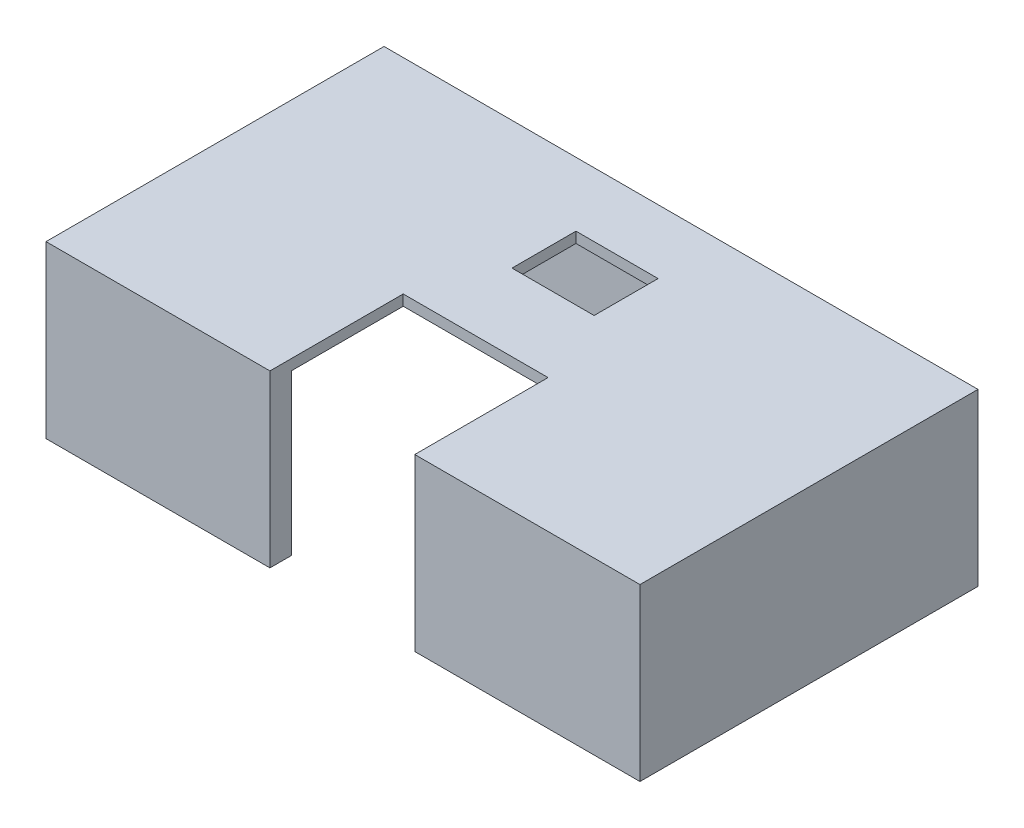
ISO-10303-21;
HEADER;
FILE_DESCRIPTION(('STEP AP214'),'2;1');
FILE_NAME('part.step','',(''),(''),'','','');
FILE_SCHEMA(('AUTOMOTIVE_DESIGN { 1 0 10303 214 1 1 1 1 }'));
ENDSEC;
DATA;
#1=APPLICATION_CONTEXT('core data for automotive mechanical design processes');
#2=APPLICATION_PROTOCOL_DEFINITION('international standard','automotive_design',2000,#1);
#3=PRODUCT_CONTEXT('',#1,'mechanical');
#4=PRODUCT('Part','Part','',(#3));
#5=PRODUCT_RELATED_PRODUCT_CATEGORY('part','',(#4));
#6=PRODUCT_DEFINITION_FORMATION('','',#4);
#7=PRODUCT_DEFINITION_CONTEXT('part definition',#1,'design');
#8=PRODUCT_DEFINITION('design','',#6,#7);
#9=PRODUCT_DEFINITION_SHAPE('','',#8);
#10=(LENGTH_UNIT() NAMED_UNIT(*) SI_UNIT(.MILLI.,.METRE.));
#11=(NAMED_UNIT(*) PLANE_ANGLE_UNIT() SI_UNIT($,.RADIAN.));
#12=(NAMED_UNIT(*) SI_UNIT($,.STERADIAN.) SOLID_ANGLE_UNIT());
#13=UNCERTAINTY_MEASURE_WITH_UNIT(LENGTH_MEASURE(1.E-05),#10,'distance_accuracy_value','');
#14=(GEOMETRIC_REPRESENTATION_CONTEXT(3) GLOBAL_UNCERTAINTY_ASSIGNED_CONTEXT((#13)) GLOBAL_UNIT_ASSIGNED_CONTEXT((#10,
#11,#12)) REPRESENTATION_CONTEXT('',''));
#15=CARTESIAN_POINT('',(0.,0.,0.));
#16=DIRECTION('',(0.,0.,1.));
#17=DIRECTION('',(1.,0.,0.));
#18=AXIS2_PLACEMENT_3D('',#15,#16,#17);
#19=CARTESIAN_POINT('',(0.,0.,0.));
#20=DIRECTION('',(0.,-1.,0.));
#21=DIRECTION('',(0.,0.,-1.));
#22=AXIS2_PLACEMENT_3D('',#19,#20,#21);
#23=PLANE('',#22);
#24=DIRECTION('',(1.,0.,0.));
#25=VECTOR('',#24,1.);
#26=CARTESIAN_POINT('',(0.,0.,-22.7));
#27=LINE('',#26,#25);
#28=CARTESIAN_POINT('',(0.,0.,-22.7));
#29=VERTEX_POINT('',#28);
#30=CARTESIAN_POINT('',(2.,0.,-22.7));
#31=VERTEX_POINT('',#30);
#32=EDGE_CURVE('E217',#29,#31,#27,.T.);
#33=ORIENTED_EDGE('',*,*,#32,.F.);
#34=DIRECTION('',(0.,0.,1.));
#35=VECTOR('',#34,1.);
#36=CARTESIAN_POINT('',(0.,0.,0.));
#37=LINE('',#36,#35);
#38=CARTESIAN_POINT('',(0.,0.,-31.7));
#39=VERTEX_POINT('',#38);
#40=EDGE_CURVE('E364',#39,#29,#37,.T.);
#41=ORIENTED_EDGE('',*,*,#40,.F.);
#42=DIRECTION('',(-1.,0.,0.));
#43=VECTOR('',#42,1.);
#44=CARTESIAN_POINT('',(0.,0.,-31.7));
#45=LINE('',#44,#43);
#46=CARTESIAN_POINT('',(55.7,0.,-31.7));
#47=VERTEX_POINT('',#46);
#48=EDGE_CURVE('E352',#47,#39,#45,.T.);
#49=ORIENTED_EDGE('',*,*,#48,.F.);
#50=DIRECTION('',(0.,0.,-1.));
#51=VECTOR('',#50,1.);
#52=CARTESIAN_POINT('',(55.7,0.,0.));
#53=LINE('',#52,#51);
#54=CARTESIAN_POINT('',(55.7,0.,0.));
#55=VERTEX_POINT('',#54);
#56=EDGE_CURVE('E372',#55,#47,#53,.T.);
#57=ORIENTED_EDGE('',*,*,#56,.F.);
#58=DIRECTION('',(1.,0.,0.));
#59=VECTOR('',#58,1.);
#60=CARTESIAN_POINT('',(0.,0.,0.));
#61=LINE('',#60,#59);
#62=CARTESIAN_POINT('',(34.5815795681262,0.,0.));
#63=VERTEX_POINT('',#62);
#64=EDGE_CURVE('E367',#63,#55,#61,.T.);
#65=ORIENTED_EDGE('',*,*,#64,.F.);
#66=DIRECTION('',(0.,0.,1.));
#67=VECTOR('',#66,1.);
#68=CARTESIAN_POINT('',(34.5815795681262,0.,-12.5));
#69=LINE('',#68,#67);
#70=CARTESIAN_POINT('',(34.5815795681262,0.,-2.));
#71=VERTEX_POINT('',#70);
#72=EDGE_CURVE('E265',#71,#63,#69,.T.);
#73=ORIENTED_EDGE('',*,*,#72,.F.);
#74=DIRECTION('',(-1.,0.,0.));
#75=VECTOR('',#74,1.);
#76=CARTESIAN_POINT('',(2.,0.,-2.));
#77=LINE('',#76,#75);
#78=CARTESIAN_POINT('',(53.7,0.,-2.));
#79=VERTEX_POINT('',#78);
#80=EDGE_CURVE('E303',#79,#71,#77,.T.);
#81=ORIENTED_EDGE('',*,*,#80,.F.);
#82=DIRECTION('',(0.,0.,1.));
#83=VECTOR('',#82,1.);
#84=CARTESIAN_POINT('',(53.7,0.,-2.));
#85=LINE('',#84,#83);
#86=CARTESIAN_POINT('',(53.7,0.,-29.7));
#87=VERTEX_POINT('',#86);
#88=EDGE_CURVE('E325',#87,#79,#85,.T.);
#89=ORIENTED_EDGE('',*,*,#88,.F.);
#90=DIRECTION('',(1.,0.,0.));
#91=VECTOR('',#90,1.);
#92=CARTESIAN_POINT('',(2.,0.,-29.7));
#93=LINE('',#92,#91);
#94=CARTESIAN_POINT('',(2.,0.,-29.7));
#95=VERTEX_POINT('',#94);
#96=EDGE_CURVE('E321',#95,#87,#93,.T.);
#97=ORIENTED_EDGE('',*,*,#96,.F.);
#98=DIRECTION('',(0.,0.,-1.));
#99=VECTOR('',#98,1.);
#100=CARTESIAN_POINT('',(2.,0.,-2.));
#101=LINE('',#100,#99);
#102=EDGE_CURVE('E297',#31,#95,#101,.T.);
#103=ORIENTED_EDGE('',*,*,#102,.F.);
#104=EDGE_LOOP('',(#33,#41,#49,#57,#65,#73,#81,#89,#97,#103));
#105=FACE_BOUND('',#104,.T.);
#106=ADVANCED_FACE('F39',(#105),#23,.T.);
#107=CARTESIAN_POINT('',(0.,16.,0.));
#108=DIRECTION('',(0.,0.,-1.));
#109=DIRECTION('',(-1.,0.,0.));
#110=AXIS2_PLACEMENT_3D('',#107,#108,#109);
#111=PLANE('',#110);
#112=DIRECTION('',(0.,-1.,0.));
#113=VECTOR('',#112,1.);
#114=CARTESIAN_POINT('',(21.,16.,0.));
#115=LINE('',#114,#113);
#116=CARTESIAN_POINT('',(21.,16.,0.));
#117=VERTEX_POINT('',#116);
#118=CARTESIAN_POINT('',(21.,0.,0.));
#119=VERTEX_POINT('',#118);
#120=EDGE_CURVE('E294',#117,#119,#115,.T.);
#121=ORIENTED_EDGE('',*,*,#120,.F.);
#122=DIRECTION('',(1.,0.,0.));
#123=VECTOR('',#122,1.);
#124=CARTESIAN_POINT('',(0.,16.,0.));
#125=LINE('',#124,#123);
#126=CARTESIAN_POINT('',(0.,16.,0.));
#127=VERTEX_POINT('',#126);
#128=EDGE_CURVE('E353',#127,#117,#125,.T.);
#129=ORIENTED_EDGE('',*,*,#128,.F.);
#130=DIRECTION('',(0.,-1.,0.));
#131=VECTOR('',#130,1.);
#132=CARTESIAN_POINT('',(0.,16.,0.));
#133=LINE('',#132,#131);
#134=CARTESIAN_POINT('',(0.,0.,0.));
#135=VERTEX_POINT('',#134);
#136=EDGE_CURVE('E388',#127,#135,#133,.T.);
#137=ORIENTED_EDGE('',*,*,#136,.T.);
#138=EDGE_CURVE('E368',#135,#119,#61,.T.);
#139=ORIENTED_EDGE('',*,*,#138,.T.);
#140=EDGE_LOOP('',(#121,#129,#137,#139));
#141=FACE_BOUND('',#140,.T.);
#142=ADVANCED_FACE('F446',(#141),#111,.F.);
#143=DIRECTION('',(0.,1.,0.));
#144=VECTOR('',#143,1.);
#145=CARTESIAN_POINT('',(34.5815795681262,16.,0.));
#146=LINE('',#145,#144);
#147=CARTESIAN_POINT('',(34.5815795681262,16.,0.));
#148=VERTEX_POINT('',#147);
#149=EDGE_CURVE('E282',#63,#148,#146,.T.);
#150=ORIENTED_EDGE('',*,*,#149,.F.);
#151=ORIENTED_EDGE('',*,*,#64,.T.);
#152=DIRECTION('',(0.,-1.,0.));
#153=VECTOR('',#152,1.);
#154=CARTESIAN_POINT('',(55.7,16.,0.));
#155=LINE('',#154,#153);
#156=CARTESIAN_POINT('',(55.7,16.,0.));
#157=VERTEX_POINT('',#156);
#158=EDGE_CURVE('E384',#157,#55,#155,.T.);
#159=ORIENTED_EDGE('',*,*,#158,.F.);
#160=EDGE_CURVE('E351',#148,#157,#125,.T.);
#161=ORIENTED_EDGE('',*,*,#160,.F.);
#162=EDGE_LOOP('',(#150,#151,#159,#161));
#163=FACE_BOUND('',#162,.T.);
#164=ADVANCED_FACE('F479',(#163),#111,.F.);
#165=CARTESIAN_POINT('',(0.,16.,0.));
#166=DIRECTION('',(0.,-1.,0.));
#167=DIRECTION('',(0.,0.,-1.));
#168=AXIS2_PLACEMENT_3D('',#165,#166,#167);
#169=PLANE('',#168);
#170=DIRECTION('',(-1.,0.,0.));
#171=VECTOR('',#170,1.);
#172=CARTESIAN_POINT('',(0.,16.,-19.7));
#173=LINE('',#172,#171);
#174=CARTESIAN_POINT('',(31.7,16.,-19.7));
#175=VERTEX_POINT('',#174);
#176=CARTESIAN_POINT('',(24.,16.,-19.7));
#177=VERTEX_POINT('',#176);
#178=EDGE_CURVE('E254',#175,#177,#173,.T.);
#179=ORIENTED_EDGE('',*,*,#178,.T.);
#180=DIRECTION('',(0.,0.,-1.));
#181=VECTOR('',#180,1.);
#182=CARTESIAN_POINT('',(24.,16.,0.));
#183=LINE('',#182,#181);
#184=CARTESIAN_POINT('',(24.,16.,-25.7));
#185=VERTEX_POINT('',#184);
#186=EDGE_CURVE('E258',#177,#185,#183,.T.);
#187=ORIENTED_EDGE('',*,*,#186,.T.);
#188=DIRECTION('',(1.,0.,0.));
#189=VECTOR('',#188,1.);
#190=CARTESIAN_POINT('',(0.,16.,-25.7));
#191=LINE('',#190,#189);
#192=CARTESIAN_POINT('',(31.7,16.,-25.7));
#193=VERTEX_POINT('',#192);
#194=EDGE_CURVE('E238',#185,#193,#191,.T.);
#195=ORIENTED_EDGE('',*,*,#194,.T.);
#196=DIRECTION('',(0.,0.,1.));
#197=VECTOR('',#196,1.);
#198=CARTESIAN_POINT('',(31.7,16.,0.));
#199=LINE('',#198,#197);
#200=EDGE_CURVE('E250',#193,#175,#199,.T.);
#201=ORIENTED_EDGE('',*,*,#200,.T.);
#202=EDGE_LOOP('',(#179,#187,#195,#201));
#203=FACE_BOUND('',#202,.T.);
#204=DIRECTION('',(0.,0.,1.));
#205=VECTOR('',#204,1.);
#206=CARTESIAN_POINT('',(21.,16.,0.));
#207=LINE('',#206,#205);
#208=CARTESIAN_POINT('',(21.,16.,-12.5));
#209=VERTEX_POINT('',#208);
#210=EDGE_CURVE('E291',#209,#117,#207,.T.);
#211=ORIENTED_EDGE('',*,*,#210,.F.);
#212=DIRECTION('',(-1.,0.,0.));
#213=VECTOR('',#212,1.);
#214=CARTESIAN_POINT('',(0.,16.,-12.5));
#215=LINE('',#214,#213);
#216=CARTESIAN_POINT('',(34.5815795681262,16.,-12.5));
#217=VERTEX_POINT('',#216);
#218=EDGE_CURVE('E285',#217,#209,#215,.T.);
#219=ORIENTED_EDGE('',*,*,#218,.F.);
#220=DIRECTION('',(0.,0.,-1.));
#221=VECTOR('',#220,1.);
#222=CARTESIAN_POINT('',(34.5815795681262,16.,0.));
#223=LINE('',#222,#221);
#224=EDGE_CURVE('E279',#148,#217,#223,.T.);
#225=ORIENTED_EDGE('',*,*,#224,.F.);
#226=ORIENTED_EDGE('',*,*,#160,.T.);
#227=DIRECTION('',(0.,0.,-1.));
#228=VECTOR('',#227,1.);
#229=CARTESIAN_POINT('',(55.7,16.,0.));
#230=LINE('',#229,#228);
#231=CARTESIAN_POINT('',(55.7,16.,-31.7));
#232=VERTEX_POINT('',#231);
#233=EDGE_CURVE('E357',#157,#232,#230,.T.);
#234=ORIENTED_EDGE('',*,*,#233,.T.);
#235=DIRECTION('',(-1.,0.,0.));
#236=VECTOR('',#235,1.);
#237=CARTESIAN_POINT('',(0.,16.,-31.7));
#238=LINE('',#237,#236);
#239=CARTESIAN_POINT('',(0.,16.,-31.7));
#240=VERTEX_POINT('',#239);
#241=EDGE_CURVE('E360',#232,#240,#238,.T.);
#242=ORIENTED_EDGE('',*,*,#241,.T.);
#243=DIRECTION('',(0.,0.,1.));
#244=VECTOR('',#243,1.);
#245=CARTESIAN_POINT('',(0.,16.,0.));
#246=LINE('',#245,#244);
#247=EDGE_CURVE('E347',#240,#127,#246,.T.);
#248=ORIENTED_EDGE('',*,*,#247,.T.);
#249=ORIENTED_EDGE('',*,*,#128,.T.);
#250=EDGE_LOOP('',(#211,#219,#225,#226,#234,#242,#248,#249));
#251=FACE_BOUND('',#250,.T.);
#252=ADVANCED_FACE('F452',(#203,#251),#169,.F.);
#253=DIRECTION('',(-1.,0.,0.));
#254=VECTOR('',#253,1.);
#255=CARTESIAN_POINT('',(0.,0.,-9.));
#256=LINE('',#255,#254);
#257=CARTESIAN_POINT('',(2.,0.,-9.));
#258=VERTEX_POINT('',#257);
#259=CARTESIAN_POINT('',(0.,0.,-9.));
#260=VERTEX_POINT('',#259);
#261=EDGE_CURVE('E202',#258,#260,#256,.T.);
#262=ORIENTED_EDGE('',*,*,#261,.F.);
#263=CARTESIAN_POINT('',(2.,0.,-2.));
#264=VERTEX_POINT('',#263);
#265=EDGE_CURVE('E317',#264,#258,#101,.T.);
#266=ORIENTED_EDGE('',*,*,#265,.F.);
#267=CARTESIAN_POINT('',(21.,0.,-2.));
#268=VERTEX_POINT('',#267);
#269=EDGE_CURVE('E329',#268,#264,#77,.T.);
#270=ORIENTED_EDGE('',*,*,#269,.F.);
#271=DIRECTION('',(0.,0.,-1.));
#272=VECTOR('',#271,1.);
#273=CARTESIAN_POINT('',(21.,0.,-12.5));
#274=LINE('',#273,#272);
#275=EDGE_CURVE('E262',#119,#268,#274,.T.);
#276=ORIENTED_EDGE('',*,*,#275,.F.);
#277=ORIENTED_EDGE('',*,*,#138,.F.);
#278=EDGE_CURVE('E337',#260,#135,#37,.T.);
#279=ORIENTED_EDGE('',*,*,#278,.F.);
#280=EDGE_LOOP('',(#262,#266,#270,#276,#277,#279));
#281=FACE_BOUND('',#280,.T.);
#282=ADVANCED_FACE('F412',(#281),#23,.T.);
#283=CARTESIAN_POINT('',(2.,15.,-2.));
#284=DIRECTION('',(0.,0.,1.));
#285=DIRECTION('',(1.,0.,0.));
#286=AXIS2_PLACEMENT_3D('',#283,#284,#285);
#287=PLANE('',#286);
#288=DIRECTION('',(0.,1.,0.));
#289=VECTOR('',#288,1.);
#290=CARTESIAN_POINT('',(21.,15.,-2.));
#291=LINE('',#290,#289);
#292=CARTESIAN_POINT('',(21.,15.,-2.));
#293=VERTEX_POINT('',#292);
#294=EDGE_CURVE('E288',#268,#293,#291,.T.);
#295=ORIENTED_EDGE('',*,*,#294,.F.);
#296=ORIENTED_EDGE('',*,*,#269,.T.);
#297=DIRECTION('',(0.,-1.,0.));
#298=VECTOR('',#297,1.);
#299=CARTESIAN_POINT('',(2.,15.,-2.));
#300=LINE('',#299,#298);
#301=CARTESIAN_POINT('',(2.,15.,-2.));
#302=VERTEX_POINT('',#301);
#303=EDGE_CURVE('E333',#302,#264,#300,.T.);
#304=ORIENTED_EDGE('',*,*,#303,.F.);
#305=DIRECTION('',(-1.,0.,0.));
#306=VECTOR('',#305,1.);
#307=CARTESIAN_POINT('',(2.,15.,-2.));
#308=LINE('',#307,#306);
#309=EDGE_CURVE('E311',#293,#302,#308,.T.);
#310=ORIENTED_EDGE('',*,*,#309,.F.);
#311=EDGE_LOOP('',(#295,#296,#304,#310));
#312=FACE_BOUND('',#311,.T.);
#313=ADVANCED_FACE('F442',(#312),#287,.F.);
#314=DIRECTION('',(0.,-1.,0.));
#315=VECTOR('',#314,1.);
#316=CARTESIAN_POINT('',(34.5815795681262,15.,-2.));
#317=LINE('',#316,#315);
#318=CARTESIAN_POINT('',(34.5815795681262,15.,-2.));
#319=VERTEX_POINT('',#318);
#320=EDGE_CURVE('E276',#319,#71,#317,.T.);
#321=ORIENTED_EDGE('',*,*,#320,.F.);
#322=CARTESIAN_POINT('',(53.7,15.,-2.));
#323=VERTEX_POINT('',#322);
#324=EDGE_CURVE('E312',#323,#319,#308,.T.);
#325=ORIENTED_EDGE('',*,*,#324,.F.);
#326=DIRECTION('',(0.,-1.,0.));
#327=VECTOR('',#326,1.);
#328=CARTESIAN_POINT('',(53.7,15.,-2.));
#329=LINE('',#328,#327);
#330=EDGE_CURVE('E338',#323,#79,#329,.T.);
#331=ORIENTED_EDGE('',*,*,#330,.T.);
#332=ORIENTED_EDGE('',*,*,#80,.T.);
#333=EDGE_LOOP('',(#321,#325,#331,#332));
#334=FACE_BOUND('',#333,.T.);
#335=ADVANCED_FACE('F487',(#334),#287,.F.);
#336=CARTESIAN_POINT('',(0.,15.,0.));
#337=DIRECTION('',(0.,-1.,0.));
#338=DIRECTION('',(0.,0.,-1.));
#339=AXIS2_PLACEMENT_3D('',#336,#337,#338);
#340=PLANE('',#339);
#341=DIRECTION('',(0.,0.,-1.));
#342=VECTOR('',#341,1.);
#343=CARTESIAN_POINT('',(24.,15.,-25.7));
#344=LINE('',#343,#342);
#345=CARTESIAN_POINT('',(24.,15.,-19.7));
#346=VERTEX_POINT('',#345);
#347=CARTESIAN_POINT('',(24.,15.,-25.7));
#348=VERTEX_POINT('',#347);
#349=EDGE_CURVE('E220',#346,#348,#344,.T.);
#350=ORIENTED_EDGE('',*,*,#349,.F.);
#351=DIRECTION('',(-1.,0.,0.));
#352=VECTOR('',#351,1.);
#353=CARTESIAN_POINT('',(24.,15.,-19.7));
#354=LINE('',#353,#352);
#355=CARTESIAN_POINT('',(31.7,15.,-19.7));
#356=VERTEX_POINT('',#355);
#357=EDGE_CURVE('E230',#356,#346,#354,.T.);
#358=ORIENTED_EDGE('',*,*,#357,.F.);
#359=DIRECTION('',(0.,0.,1.));
#360=VECTOR('',#359,1.);
#361=CARTESIAN_POINT('',(31.7,15.,-25.7));
#362=LINE('',#361,#360);
#363=CARTESIAN_POINT('',(31.7,15.,-25.7));
#364=VERTEX_POINT('',#363);
#365=EDGE_CURVE('E226',#364,#356,#362,.T.);
#366=ORIENTED_EDGE('',*,*,#365,.F.);
#367=DIRECTION('',(1.,0.,0.));
#368=VECTOR('',#367,1.);
#369=CARTESIAN_POINT('',(24.,15.,-25.7));
#370=LINE('',#369,#368);
#371=EDGE_CURVE('E223',#348,#364,#370,.T.);
#372=ORIENTED_EDGE('',*,*,#371,.F.);
#373=EDGE_LOOP('',(#350,#358,#366,#372));
#374=FACE_BOUND('',#373,.T.);
#375=DIRECTION('',(-1.,0.,0.));
#376=VECTOR('',#375,1.);
#377=CARTESIAN_POINT('',(0.,15.,-12.5));
#378=LINE('',#377,#376);
#379=CARTESIAN_POINT('',(34.5815795681262,15.,-12.5));
#380=VERTEX_POINT('',#379);
#381=CARTESIAN_POINT('',(21.,15.,-12.5));
#382=VERTEX_POINT('',#381);
#383=EDGE_CURVE('E396',#380,#382,#378,.T.);
#384=ORIENTED_EDGE('',*,*,#383,.T.);
#385=DIRECTION('',(0.,0.,1.));
#386=VECTOR('',#385,1.);
#387=CARTESIAN_POINT('',(21.,15.,0.));
#388=LINE('',#387,#386);
#389=EDGE_CURVE('E400',#382,#293,#388,.T.);
#390=ORIENTED_EDGE('',*,*,#389,.T.);
#391=ORIENTED_EDGE('',*,*,#309,.T.);
#392=DIRECTION('',(0.,0.,-1.));
#393=VECTOR('',#392,1.);
#394=CARTESIAN_POINT('',(2.,15.,-2.));
#395=LINE('',#394,#393);
#396=CARTESIAN_POINT('',(2.,15.,-29.7));
#397=VERTEX_POINT('',#396);
#398=EDGE_CURVE('E298',#302,#397,#395,.T.);
#399=ORIENTED_EDGE('',*,*,#398,.T.);
#400=DIRECTION('',(1.,0.,0.));
#401=VECTOR('',#400,1.);
#402=CARTESIAN_POINT('',(2.,15.,-29.7));
#403=LINE('',#402,#401);
#404=CARTESIAN_POINT('',(53.7,15.,-29.7));
#405=VERTEX_POINT('',#404);
#406=EDGE_CURVE('E302',#397,#405,#403,.T.);
#407=ORIENTED_EDGE('',*,*,#406,.T.);
#408=DIRECTION('',(0.,0.,1.));
#409=VECTOR('',#408,1.);
#410=CARTESIAN_POINT('',(53.7,15.,-2.));
#411=LINE('',#410,#409);
#412=EDGE_CURVE('E307',#405,#323,#411,.T.);
#413=ORIENTED_EDGE('',*,*,#412,.T.);
#414=ORIENTED_EDGE('',*,*,#324,.T.);
#415=DIRECTION('',(0.,0.,-1.));
#416=VECTOR('',#415,1.);
#417=CARTESIAN_POINT('',(34.5815795681262,15.,0.));
#418=LINE('',#417,#416);
#419=EDGE_CURVE('E392',#319,#380,#418,.T.);
#420=ORIENTED_EDGE('',*,*,#419,.T.);
#421=EDGE_LOOP('',(#384,#390,#391,#399,#407,#413,#414,#420));
#422=FACE_BOUND('',#421,.T.);
#423=ADVANCED_FACE('F437',(#374,#422),#340,.T.);
#424=CARTESIAN_POINT('',(0.,16.,0.));
#425=DIRECTION('',(1.,0.,0.));
#426=DIRECTION('',(0.,0.,-1.));
#427=AXIS2_PLACEMENT_3D('',#424,#425,#426);
#428=PLANE('',#427);
#429=ORIENTED_EDGE('',*,*,#40,.T.);
#430=DIRECTION('',(0.,-1.,0.));
#431=VECTOR('',#430,1.);
#432=CARTESIAN_POINT('',(0.,14.2830810966552,-22.7));
#433=LINE('',#432,#431);
#434=CARTESIAN_POINT('',(0.,14.2830810966552,-22.7));
#435=VERTEX_POINT('',#434);
#436=EDGE_CURVE('E206',#435,#29,#433,.T.);
#437=ORIENTED_EDGE('',*,*,#436,.F.);
#438=DIRECTION('',(0.,0.,-1.));
#439=VECTOR('',#438,1.);
#440=CARTESIAN_POINT('',(0.,14.2830810966552,-22.7));
#441=LINE('',#440,#439);
#442=CARTESIAN_POINT('',(0.,14.2830810966552,-9.));
#443=VERTEX_POINT('',#442);
#444=EDGE_CURVE('E191',#443,#435,#441,.T.);
#445=ORIENTED_EDGE('',*,*,#444,.F.);
#446=DIRECTION('',(0.,1.,0.));
#447=VECTOR('',#446,1.);
#448=CARTESIAN_POINT('',(0.,14.2830810966552,-9.));
#449=LINE('',#448,#447);
#450=EDGE_CURVE('E199',#260,#443,#449,.T.);
#451=ORIENTED_EDGE('',*,*,#450,.F.);
#452=ORIENTED_EDGE('',*,*,#278,.T.);
#453=ORIENTED_EDGE('',*,*,#136,.F.);
#454=ORIENTED_EDGE('',*,*,#247,.F.);
#455=DIRECTION('',(0.,-1.,0.));
#456=VECTOR('',#455,1.);
#457=CARTESIAN_POINT('',(0.,16.,-31.7));
#458=LINE('',#457,#456);
#459=EDGE_CURVE('E363',#240,#39,#458,.T.);
#460=ORIENTED_EDGE('',*,*,#459,.T.);
#461=EDGE_LOOP('',(#429,#437,#445,#451,#452,#453,#454,#460));
#462=FACE_BOUND('',#461,.T.);
#463=ADVANCED_FACE('F41',(#462),#428,.F.);
#464=CARTESIAN_POINT('',(55.7,16.,0.));
#465=DIRECTION('',(-1.,0.,0.));
#466=DIRECTION('',(0.,0.,1.));
#467=AXIS2_PLACEMENT_3D('',#464,#465,#466);
#468=PLANE('',#467);
#469=ORIENTED_EDGE('',*,*,#56,.T.);
#470=DIRECTION('',(0.,-1.,0.));
#471=VECTOR('',#470,1.);
#472=CARTESIAN_POINT('',(55.7,16.,-31.7));
#473=LINE('',#472,#471);
#474=EDGE_CURVE('E380',#232,#47,#473,.T.);
#475=ORIENTED_EDGE('',*,*,#474,.F.);
#476=ORIENTED_EDGE('',*,*,#233,.F.);
#477=ORIENTED_EDGE('',*,*,#158,.T.);
#478=EDGE_LOOP('',(#469,#475,#476,#477));
#479=FACE_BOUND('',#478,.T.);
#480=ADVANCED_FACE('F578',(#479),#468,.F.);
#481=CARTESIAN_POINT('',(0.,16.,-31.7));
#482=DIRECTION('',(0.,0.,1.));
#483=DIRECTION('',(1.,0.,0.));
#484=AXIS2_PLACEMENT_3D('',#481,#482,#483);
#485=PLANE('',#484);
#486=ORIENTED_EDGE('',*,*,#48,.T.);
#487=ORIENTED_EDGE('',*,*,#459,.F.);
#488=ORIENTED_EDGE('',*,*,#241,.F.);
#489=ORIENTED_EDGE('',*,*,#474,.T.);
#490=EDGE_LOOP('',(#486,#487,#488,#489));
#491=FACE_BOUND('',#490,.T.);
#492=ADVANCED_FACE('F457',(#491),#485,.F.);
#493=CARTESIAN_POINT('',(2.,15.,-2.));
#494=DIRECTION('',(-1.,0.,0.));
#495=DIRECTION('',(0.,0.,1.));
#496=AXIS2_PLACEMENT_3D('',#493,#494,#495);
#497=PLANE('',#496);
#498=DIRECTION('',(0.,0.,-1.));
#499=VECTOR('',#498,1.);
#500=CARTESIAN_POINT('',(2.,14.2830810966552,-2.));
#501=LINE('',#500,#499);
#502=CARTESIAN_POINT('',(2.,14.2830810966552,-9.));
#503=VERTEX_POINT('',#502);
#504=CARTESIAN_POINT('',(2.,14.2830810966552,-22.7));
#505=VERTEX_POINT('',#504);
#506=EDGE_CURVE('E48',#503,#505,#501,.T.);
#507=ORIENTED_EDGE('',*,*,#506,.T.);
#508=DIRECTION('',(0.,-1.,0.));
#509=VECTOR('',#508,1.);
#510=CARTESIAN_POINT('',(2.,15.,-22.7));
#511=LINE('',#510,#509);
#512=EDGE_CURVE('E11',#505,#31,#511,.T.);
#513=ORIENTED_EDGE('',*,*,#512,.T.);
#514=ORIENTED_EDGE('',*,*,#102,.T.);
#515=DIRECTION('',(0.,-1.,0.));
#516=VECTOR('',#515,1.);
#517=CARTESIAN_POINT('',(2.,15.,-29.7));
#518=LINE('',#517,#516);
#519=EDGE_CURVE('E316',#397,#95,#518,.T.);
#520=ORIENTED_EDGE('',*,*,#519,.F.);
#521=ORIENTED_EDGE('',*,*,#398,.F.);
#522=ORIENTED_EDGE('',*,*,#303,.T.);
#523=ORIENTED_EDGE('',*,*,#265,.T.);
#524=DIRECTION('',(0.,1.,0.));
#525=VECTOR('',#524,1.);
#526=CARTESIAN_POINT('',(2.,15.,-9.));
#527=LINE('',#526,#525);
#528=EDGE_CURVE('E404',#258,#503,#527,.T.);
#529=ORIENTED_EDGE('',*,*,#528,.T.);
#530=EDGE_LOOP('',(#507,#513,#514,#520,#521,#522,#523,#529));
#531=FACE_BOUND('',#530,.T.);
#532=ADVANCED_FACE('F408',(#531),#497,.F.);
#533=CARTESIAN_POINT('',(53.7,15.,-2.));
#534=DIRECTION('',(1.,0.,0.));
#535=DIRECTION('',(0.,0.,-1.));
#536=AXIS2_PLACEMENT_3D('',#533,#534,#535);
#537=PLANE('',#536);
#538=ORIENTED_EDGE('',*,*,#88,.T.);
#539=ORIENTED_EDGE('',*,*,#330,.F.);
#540=ORIENTED_EDGE('',*,*,#412,.F.);
#541=DIRECTION('',(0.,-1.,0.));
#542=VECTOR('',#541,1.);
#543=CARTESIAN_POINT('',(53.7,15.,-29.7));
#544=LINE('',#543,#542);
#545=EDGE_CURVE('E341',#405,#87,#544,.T.);
#546=ORIENTED_EDGE('',*,*,#545,.T.);
#547=EDGE_LOOP('',(#538,#539,#540,#546));
#548=FACE_BOUND('',#547,.T.);
#549=ADVANCED_FACE('F433',(#548),#537,.F.);
#550=CARTESIAN_POINT('',(2.,15.,-29.7));
#551=DIRECTION('',(0.,0.,-1.));
#552=DIRECTION('',(-1.,0.,0.));
#553=AXIS2_PLACEMENT_3D('',#550,#551,#552);
#554=PLANE('',#553);
#555=ORIENTED_EDGE('',*,*,#96,.T.);
#556=ORIENTED_EDGE('',*,*,#545,.F.);
#557=ORIENTED_EDGE('',*,*,#406,.F.);
#558=ORIENTED_EDGE('',*,*,#519,.T.);
#559=EDGE_LOOP('',(#555,#556,#557,#558));
#560=FACE_BOUND('',#559,.T.);
#561=ADVANCED_FACE('F428',(#560),#554,.F.);
#562=CARTESIAN_POINT('',(21.,0.,-12.5));
#563=DIRECTION('',(1.,0.,0.));
#564=DIRECTION('',(0.,0.,-1.));
#565=AXIS2_PLACEMENT_3D('',#562,#563,#564);
#566=PLANE('',#565);
#567=ORIENTED_EDGE('',*,*,#120,.T.);
#568=ORIENTED_EDGE('',*,*,#275,.T.);
#569=ORIENTED_EDGE('',*,*,#294,.T.);
#570=ORIENTED_EDGE('',*,*,#389,.F.);
#571=DIRECTION('',(0.,1.,0.));
#572=VECTOR('',#571,1.);
#573=CARTESIAN_POINT('',(21.,0.,-12.5));
#574=LINE('',#573,#572);
#575=EDGE_CURVE('E272',#382,#209,#574,.T.);
#576=ORIENTED_EDGE('',*,*,#575,.T.);
#577=ORIENTED_EDGE('',*,*,#210,.T.);
#578=EDGE_LOOP('',(#567,#568,#569,#570,#576,#577));
#579=FACE_BOUND('',#578,.T.);
#580=ADVANCED_FACE('F499',(#579),#566,.T.);
#581=CARTESIAN_POINT('',(21.,0.,-12.5));
#582=DIRECTION('',(0.,0.,1.));
#583=DIRECTION('',(1.,0.,0.));
#584=AXIS2_PLACEMENT_3D('',#581,#582,#583);
#585=PLANE('',#584);
#586=ORIENTED_EDGE('',*,*,#218,.T.);
#587=ORIENTED_EDGE('',*,*,#575,.F.);
#588=ORIENTED_EDGE('',*,*,#383,.F.);
#589=DIRECTION('',(0.,1.,0.));
#590=VECTOR('',#589,1.);
#591=CARTESIAN_POINT('',(34.5815795681262,0.,-12.5));
#592=LINE('',#591,#590);
#593=EDGE_CURVE('E268',#380,#217,#592,.T.);
#594=ORIENTED_EDGE('',*,*,#593,.T.);
#595=EDGE_LOOP('',(#586,#587,#588,#594));
#596=FACE_BOUND('',#595,.T.);
#597=ADVANCED_FACE('F507',(#596),#585,.T.);
#598=CARTESIAN_POINT('',(34.5815795681262,0.,-12.5));
#599=DIRECTION('',(-1.,0.,0.));
#600=DIRECTION('',(0.,0.,1.));
#601=AXIS2_PLACEMENT_3D('',#598,#599,#600);
#602=PLANE('',#601);
#603=ORIENTED_EDGE('',*,*,#149,.T.);
#604=ORIENTED_EDGE('',*,*,#224,.T.);
#605=ORIENTED_EDGE('',*,*,#593,.F.);
#606=ORIENTED_EDGE('',*,*,#419,.F.);
#607=ORIENTED_EDGE('',*,*,#320,.T.);
#608=ORIENTED_EDGE('',*,*,#72,.T.);
#609=EDGE_LOOP('',(#603,#604,#605,#606,#607,#608));
#610=FACE_BOUND('',#609,.T.);
#611=ADVANCED_FACE('F510',(#610),#602,.T.);
#612=CARTESIAN_POINT('',(24.,25.,-25.7));
#613=DIRECTION('',(-1.,0.,0.));
#614=DIRECTION('',(0.,0.,1.));
#615=AXIS2_PLACEMENT_3D('',#612,#613,#614);
#616=PLANE('',#615);
#617=DIRECTION('',(0.,-1.,0.));
#618=VECTOR('',#617,1.);
#619=CARTESIAN_POINT('',(24.,25.,-19.7));
#620=LINE('',#619,#618);
#621=EDGE_CURVE('E235',#177,#346,#620,.T.);
#622=ORIENTED_EDGE('',*,*,#621,.T.);
#623=ORIENTED_EDGE('',*,*,#349,.T.);
#624=DIRECTION('',(0.,-1.,0.));
#625=VECTOR('',#624,1.);
#626=CARTESIAN_POINT('',(24.,25.,-25.7));
#627=LINE('',#626,#625);
#628=EDGE_CURVE('E234',#185,#348,#627,.T.);
#629=ORIENTED_EDGE('',*,*,#628,.F.);
#630=ORIENTED_EDGE('',*,*,#186,.F.);
#631=EDGE_LOOP('',(#622,#623,#629,#630));
#632=FACE_BOUND('',#631,.T.);
#633=ADVANCED_FACE('F514',(#632),#616,.F.);
#634=CARTESIAN_POINT('',(24.,25.,-19.7));
#635=DIRECTION('',(0.,0.,1.));
#636=DIRECTION('',(1.,0.,0.));
#637=AXIS2_PLACEMENT_3D('',#634,#635,#636);
#638=PLANE('',#637);
#639=DIRECTION('',(0.,-1.,0.));
#640=VECTOR('',#639,1.);
#641=CARTESIAN_POINT('',(31.7,25.,-19.7));
#642=LINE('',#641,#640);
#643=EDGE_CURVE('E239',#175,#356,#642,.T.);
#644=ORIENTED_EDGE('',*,*,#643,.T.);
#645=ORIENTED_EDGE('',*,*,#357,.T.);
#646=ORIENTED_EDGE('',*,*,#621,.F.);
#647=ORIENTED_EDGE('',*,*,#178,.F.);
#648=EDGE_LOOP('',(#644,#645,#646,#647));
#649=FACE_BOUND('',#648,.T.);
#650=ADVANCED_FACE('F518',(#649),#638,.F.);
#651=CARTESIAN_POINT('',(31.7,25.,-25.7));
#652=DIRECTION('',(1.,0.,0.));
#653=DIRECTION('',(0.,0.,-1.));
#654=AXIS2_PLACEMENT_3D('',#651,#652,#653);
#655=PLANE('',#654);
#656=DIRECTION('',(0.,-1.,0.));
#657=VECTOR('',#656,1.);
#658=CARTESIAN_POINT('',(31.7,25.,-25.7));
#659=LINE('',#658,#657);
#660=EDGE_CURVE('E63',#193,#364,#659,.T.);
#661=ORIENTED_EDGE('',*,*,#660,.T.);
#662=ORIENTED_EDGE('',*,*,#365,.T.);
#663=ORIENTED_EDGE('',*,*,#643,.F.);
#664=ORIENTED_EDGE('',*,*,#200,.F.);
#665=EDGE_LOOP('',(#661,#662,#663,#664));
#666=FACE_BOUND('',#665,.T.);
#667=ADVANCED_FACE('F522',(#666),#655,.F.);
#668=CARTESIAN_POINT('',(24.,25.,-25.7));
#669=DIRECTION('',(0.,0.,-1.));
#670=DIRECTION('',(-1.,0.,0.));
#671=AXIS2_PLACEMENT_3D('',#668,#669,#670);
#672=PLANE('',#671);
#673=ORIENTED_EDGE('',*,*,#628,.T.);
#674=ORIENTED_EDGE('',*,*,#371,.T.);
#675=ORIENTED_EDGE('',*,*,#660,.F.);
#676=ORIENTED_EDGE('',*,*,#194,.F.);
#677=EDGE_LOOP('',(#673,#674,#675,#676));
#678=FACE_BOUND('',#677,.T.);
#679=ADVANCED_FACE('F471',(#678),#672,.F.);
#680=CARTESIAN_POINT('',(10.,14.2830810966552,-22.7));
#681=DIRECTION('',(0.,1.,0.));
#682=DIRECTION('',(0.,0.,1.));
#683=AXIS2_PLACEMENT_3D('',#680,#681,#682);
#684=PLANE('',#683);
#685=DIRECTION('',(-1.,0.,0.));
#686=VECTOR('',#685,1.);
#687=CARTESIAN_POINT('',(10.,14.2830810966552,-9.));
#688=LINE('',#687,#686);
#689=EDGE_CURVE('E55',#503,#443,#688,.T.);
#690=ORIENTED_EDGE('',*,*,#689,.T.);
#691=ORIENTED_EDGE('',*,*,#444,.T.);
#692=DIRECTION('',(-1.,0.,0.));
#693=VECTOR('',#692,1.);
#694=CARTESIAN_POINT('',(10.,14.2830810966552,-22.7));
#695=LINE('',#694,#693);
#696=EDGE_CURVE('E196',#505,#435,#695,.T.);
#697=ORIENTED_EDGE('',*,*,#696,.F.);
#698=ORIENTED_EDGE('',*,*,#506,.F.);
#699=EDGE_LOOP('',(#690,#691,#697,#698));
#700=FACE_BOUND('',#699,.T.);
#701=ADVANCED_FACE('F188',(#700),#684,.F.);
#702=CARTESIAN_POINT('',(10.,14.2830810966552,-22.7));
#703=DIRECTION('',(0.,0.,-1.));
#704=DIRECTION('',(-1.,0.,0.));
#705=AXIS2_PLACEMENT_3D('',#702,#703,#704);
#706=PLANE('',#705);
#707=ORIENTED_EDGE('',*,*,#32,.T.);
#708=ORIENTED_EDGE('',*,*,#512,.F.);
#709=ORIENTED_EDGE('',*,*,#696,.T.);
#710=ORIENTED_EDGE('',*,*,#436,.T.);
#711=EDGE_LOOP('',(#707,#708,#709,#710));
#712=FACE_BOUND('',#711,.T.);
#713=ADVANCED_FACE('F462',(#712),#706,.F.);
#714=CARTESIAN_POINT('',(10.,14.2830810966552,-9.));
#715=DIRECTION('',(0.,0.,1.));
#716=DIRECTION('',(1.,0.,0.));
#717=AXIS2_PLACEMENT_3D('',#714,#715,#716);
#718=PLANE('',#717);
#719=ORIENTED_EDGE('',*,*,#261,.T.);
#720=ORIENTED_EDGE('',*,*,#450,.T.);
#721=ORIENTED_EDGE('',*,*,#689,.F.);
#722=ORIENTED_EDGE('',*,*,#528,.F.);
#723=EDGE_LOOP('',(#719,#720,#721,#722));
#724=FACE_BOUND('',#723,.T.);
#725=ADVANCED_FACE('F200',(#724),#718,.F.);
#726=CLOSED_SHELL('',(#106,#142,#164,#252,#282,#313,#335,#423,#463,#480,#492,#532,#549,#561,
#580,#597,#611,#633,#650,#667,#679,#701,#713,#725));
#727=MANIFOLD_SOLID_BREP('B2',#726);
#728=ADVANCED_BREP_SHAPE_REPRESENTATION('',(#18,#727),#14);
#729=SHAPE_DEFINITION_REPRESENTATION(#9,#728);
ENDSEC;
END-ISO-10303-21;
